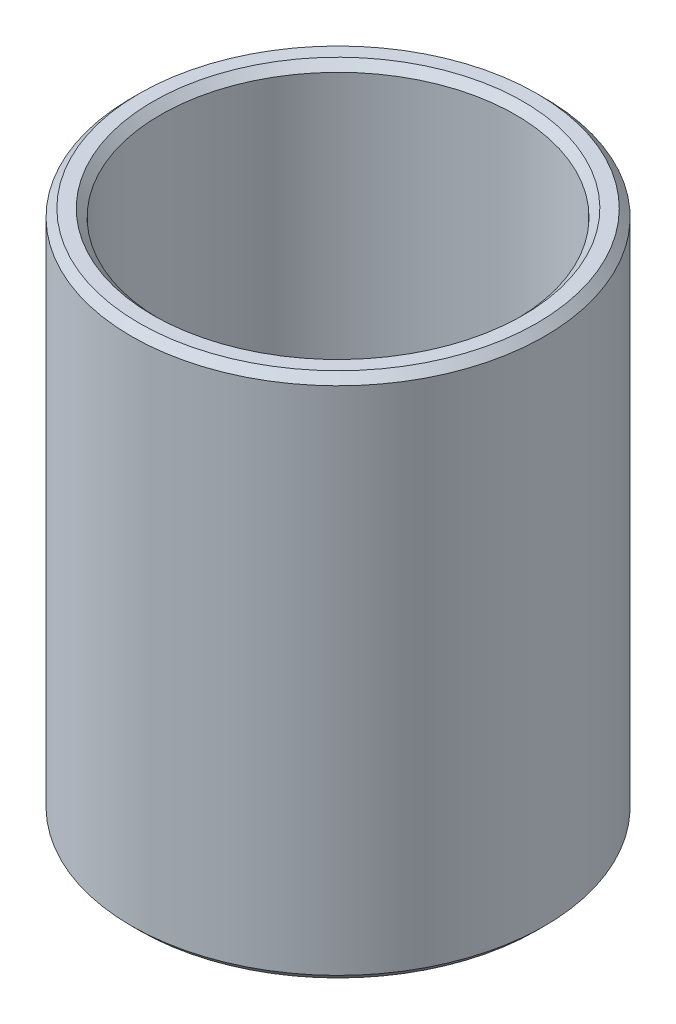
ISO-10303-21;
HEADER;
FILE_DESCRIPTION(('STEP AP214'),'2;1');
FILE_NAME('part.step','',(''),(''),'','','');
FILE_SCHEMA(('AUTOMOTIVE_DESIGN { 1 0 10303 214 1 1 1 1 }'));
ENDSEC;
DATA;
#1=APPLICATION_CONTEXT('core data for automotive mechanical design processes');
#2=APPLICATION_PROTOCOL_DEFINITION('international standard','automotive_design',2000,#1);
#3=PRODUCT_CONTEXT('',#1,'mechanical');
#4=PRODUCT('Part','Part','',(#3));
#5=PRODUCT_RELATED_PRODUCT_CATEGORY('part','',(#4));
#6=PRODUCT_DEFINITION_FORMATION('','',#4);
#7=PRODUCT_DEFINITION_CONTEXT('part definition',#1,'design');
#8=PRODUCT_DEFINITION('design','',#6,#7);
#9=PRODUCT_DEFINITION_SHAPE('','',#8);
#10=(LENGTH_UNIT() NAMED_UNIT(*) SI_UNIT(.MILLI.,.METRE.));
#11=(NAMED_UNIT(*) PLANE_ANGLE_UNIT() SI_UNIT($,.RADIAN.));
#12=(NAMED_UNIT(*) SI_UNIT($,.STERADIAN.) SOLID_ANGLE_UNIT());
#13=UNCERTAINTY_MEASURE_WITH_UNIT(LENGTH_MEASURE(1.E-05),#10,'distance_accuracy_value','');
#14=(GEOMETRIC_REPRESENTATION_CONTEXT(3) GLOBAL_UNCERTAINTY_ASSIGNED_CONTEXT((#13)) GLOBAL_UNIT_ASSIGNED_CONTEXT((#10,
#11,#12)) REPRESENTATION_CONTEXT('',''));
#15=CARTESIAN_POINT('',(0.,0.,0.));
#16=DIRECTION('',(0.,0.,1.));
#17=DIRECTION('',(1.,0.,0.));
#18=AXIS2_PLACEMENT_3D('',#15,#16,#17);
#19=CARTESIAN_POINT('',(0.,76.3998026897222,0.));
#20=DIRECTION('',(0.,-1.,0.));
#21=DIRECTION('',(0.,0.,-1.));
#22=AXIS2_PLACEMENT_3D('',#19,#20,#21);
#23=CYLINDRICAL_SURFACE('',#22,30.);
#24=CARTESIAN_POINT('',(0.,1.11173082783092,0.));
#25=DIRECTION('',(0.,1.,0.));
#26=DIRECTION('',(0.,0.,1.));
#27=AXIS2_PLACEMENT_3D('',#24,#25,#26);
#28=CIRCLE('',#27,30.);
#29=CARTESIAN_POINT('',(0.,1.11173082783092,30.));
#30=VERTEX_POINT('',#29);
#31=EDGE_CURVE('E10',#30,#30,#28,.T.);
#32=ORIENTED_EDGE('',*,*,#31,.T.);
#33=EDGE_LOOP('',(#32));
#34=FACE_BOUND('',#33,.T.);
#35=CARTESIAN_POINT('',(0.,75.2880718618913,0.));
#36=DIRECTION('',(0.,1.,0.));
#37=DIRECTION('',(0.,0.,1.));
#38=AXIS2_PLACEMENT_3D('',#35,#36,#37);
#39=CIRCLE('',#38,30.);
#40=CARTESIAN_POINT('',(0.,75.2880718618913,30.));
#41=VERTEX_POINT('',#40);
#42=EDGE_CURVE('E50',#41,#41,#39,.F.);
#43=ORIENTED_EDGE('',*,*,#42,.T.);
#44=EDGE_LOOP('',(#43));
#45=FACE_BOUND('',#44,.T.);
#46=ADVANCED_FACE('F39',(#34,#45),#23,.T.);
#47=CARTESIAN_POINT('',(0.,76.3998026897222,0.));
#48=DIRECTION('',(0.,1.,0.));
#49=DIRECTION('',(0.,0.,1.));
#50=AXIS2_PLACEMENT_3D('',#47,#48,#49);
#51=PLANE('',#50);
#52=CARTESIAN_POINT('',(0.,76.3998026897222,0.));
#53=DIRECTION('',(0.,1.,0.));
#54=DIRECTION('',(0.,0.,1.));
#55=AXIS2_PLACEMENT_3D('',#52,#53,#54);
#56=CIRCLE('',#55,26.8953682178952);
#57=CARTESIAN_POINT('',(0.,76.3998026897222,26.8953682178952));
#58=VERTEX_POINT('',#57);
#59=EDGE_CURVE('E58',#58,#58,#56,.F.);
#60=ORIENTED_EDGE('',*,*,#59,.T.);
#61=EDGE_LOOP('',(#60));
#62=FACE_BOUND('',#61,.T.);
#63=CARTESIAN_POINT('',(0.,76.3998026897222,0.));
#64=DIRECTION('',(0.,1.,0.));
#65=DIRECTION('',(0.,0.,1.));
#66=AXIS2_PLACEMENT_3D('',#63,#64,#65);
#67=CIRCLE('',#66,28.888269172169);
#68=CARTESIAN_POINT('',(0.,76.3998026897222,28.888269172169));
#69=VERTEX_POINT('',#68);
#70=EDGE_CURVE('E61',#69,#69,#67,.T.);
#71=ORIENTED_EDGE('',*,*,#70,.T.);
#72=EDGE_LOOP('',(#71));
#73=FACE_BOUND('',#72,.T.);
#74=ADVANCED_FACE('F88',(#62,#73),#51,.T.);
#75=CARTESIAN_POINT('',(0.,0.,0.));
#76=DIRECTION('',(0.,1.,0.));
#77=DIRECTION('',(0.,0.,1.));
#78=AXIS2_PLACEMENT_3D('',#75,#76,#77);
#79=PLANE('',#78);
#80=CARTESIAN_POINT('',(0.,0.,0.));
#81=DIRECTION('',(0.,1.,0.));
#82=DIRECTION('',(0.,0.,1.));
#83=AXIS2_PLACEMENT_3D('',#80,#81,#82);
#84=CIRCLE('',#83,26.8953682178952);
#85=CARTESIAN_POINT('',(0.,0.,26.8953682178952));
#86=VERTEX_POINT('',#85);
#87=EDGE_CURVE('E51',#86,#86,#84,.T.);
#88=ORIENTED_EDGE('',*,*,#87,.T.);
#89=EDGE_LOOP('',(#88));
#90=FACE_BOUND('',#89,.T.);
#91=CARTESIAN_POINT('',(0.,0.,0.));
#92=DIRECTION('',(0.,1.,0.));
#93=DIRECTION('',(0.,0.,1.));
#94=AXIS2_PLACEMENT_3D('',#91,#92,#93);
#95=CIRCLE('',#94,28.8882691721691);
#96=CARTESIAN_POINT('',(0.,0.,28.8882691721691));
#97=VERTEX_POINT('',#96);
#98=EDGE_CURVE('E54',#97,#97,#95,.F.);
#99=ORIENTED_EDGE('',*,*,#98,.T.);
#100=EDGE_LOOP('',(#99));
#101=FACE_BOUND('',#100,.T.);
#102=ADVANCED_FACE('F83',(#90,#101),#79,.F.);
#103=CARTESIAN_POINT('',(0.,76.3998026897222,0.));
#104=DIRECTION('',(0.,-1.,0.));
#105=DIRECTION('',(0.,0.,-1.));
#106=AXIS2_PLACEMENT_3D('',#103,#104,#105);
#107=CYLINDRICAL_SURFACE('',#106,25.7836373900642);
#108=CARTESIAN_POINT('',(0.,75.2880718618913,0.));
#109=DIRECTION('',(0.,1.,0.));
#110=DIRECTION('',(0.,0.,1.));
#111=AXIS2_PLACEMENT_3D('',#108,#109,#110);
#112=CIRCLE('',#111,25.7836373900642);
#113=CARTESIAN_POINT('',(0.,75.2880718618913,25.7836373900642));
#114=VERTEX_POINT('',#113);
#115=EDGE_CURVE('E67',#114,#114,#112,.T.);
#116=ORIENTED_EDGE('',*,*,#115,.T.);
#117=EDGE_LOOP('',(#116));
#118=FACE_BOUND('',#117,.T.);
#119=CARTESIAN_POINT('',(0.,1.11173082783095,0.));
#120=DIRECTION('',(0.,1.,0.));
#121=DIRECTION('',(0.,0.,1.));
#122=AXIS2_PLACEMENT_3D('',#119,#120,#121);
#123=CIRCLE('',#122,25.7836373900642);
#124=CARTESIAN_POINT('',(0.,1.11173082783095,25.7836373900642));
#125=VERTEX_POINT('',#124);
#126=EDGE_CURVE('E69',#125,#125,#123,.F.);
#127=ORIENTED_EDGE('',*,*,#126,.T.);
#128=EDGE_LOOP('',(#127));
#129=FACE_BOUND('',#128,.T.);
#130=ADVANCED_FACE('F71',(#118,#129),#107,.F.);
#131=CARTESIAN_POINT('',(0.,75.2880718618913,0.));
#132=DIRECTION('',(0.,1.,0.));
#133=DIRECTION('',(0.,0.,1.));
#134=AXIS2_PLACEMENT_3D('',#131,#132,#133);
#135=CONICAL_SURFACE('',#134,25.7836373900642,0.78539816339745);
#136=ORIENTED_EDGE('',*,*,#59,.F.);
#137=EDGE_LOOP('',(#136));
#138=FACE_BOUND('',#137,.T.);
#139=ORIENTED_EDGE('',*,*,#115,.F.);
#140=EDGE_LOOP('',(#139));
#141=FACE_BOUND('',#140,.T.);
#142=ADVANCED_FACE('F77',(#138,#141),#135,.F.);
#143=CARTESIAN_POINT('',(0.,0.,0.));
#144=DIRECTION('',(0.,-1.,0.));
#145=DIRECTION('',(0.,0.,-1.));
#146=AXIS2_PLACEMENT_3D('',#143,#144,#145);
#147=CONICAL_SURFACE('',#146,26.8953682178952,0.785398163397447);
#148=ORIENTED_EDGE('',*,*,#126,.F.);
#149=EDGE_LOOP('',(#148));
#150=FACE_BOUND('',#149,.T.);
#151=ORIENTED_EDGE('',*,*,#87,.F.);
#152=EDGE_LOOP('',(#151));
#153=FACE_BOUND('',#152,.T.);
#154=ADVANCED_FACE('F73',(#150,#153),#147,.F.);
#155=CARTESIAN_POINT('',(0.,1.11173082783092,0.));
#156=DIRECTION('',(0.,1.,0.));
#157=DIRECTION('',(0.,0.,1.));
#158=AXIS2_PLACEMENT_3D('',#155,#156,#157);
#159=CONICAL_SURFACE('',#158,30.,0.785398163397448);
#160=ORIENTED_EDGE('',*,*,#98,.F.);
#161=EDGE_LOOP('',(#160));
#162=FACE_BOUND('',#161,.T.);
#163=ORIENTED_EDGE('',*,*,#31,.F.);
#164=EDGE_LOOP('',(#163));
#165=FACE_BOUND('',#164,.T.);
#166=ADVANCED_FACE('F76',(#162,#165),#159,.T.);
#167=CARTESIAN_POINT('',(0.,76.3998026897222,0.));
#168=DIRECTION('',(0.,-1.,0.));
#169=DIRECTION('',(0.,0.,-1.));
#170=AXIS2_PLACEMENT_3D('',#167,#168,#169);
#171=CONICAL_SURFACE('',#170,28.888269172169,0.785398163397448);
#172=ORIENTED_EDGE('',*,*,#42,.F.);
#173=EDGE_LOOP('',(#172));
#174=FACE_BOUND('',#173,.T.);
#175=ORIENTED_EDGE('',*,*,#70,.F.);
#176=EDGE_LOOP('',(#175));
#177=FACE_BOUND('',#176,.T.);
#178=ADVANCED_FACE('F45',(#174,#177),#171,.T.);
#179=CLOSED_SHELL('',(#46,#74,#102,#130,#142,#154,#166,#178));
#180=MANIFOLD_SOLID_BREP('B2',#179);
#181=ADVANCED_BREP_SHAPE_REPRESENTATION('',(#18,#180),#14);
#182=SHAPE_DEFINITION_REPRESENTATION(#9,#181);
ENDSEC;
END-ISO-10303-21;
